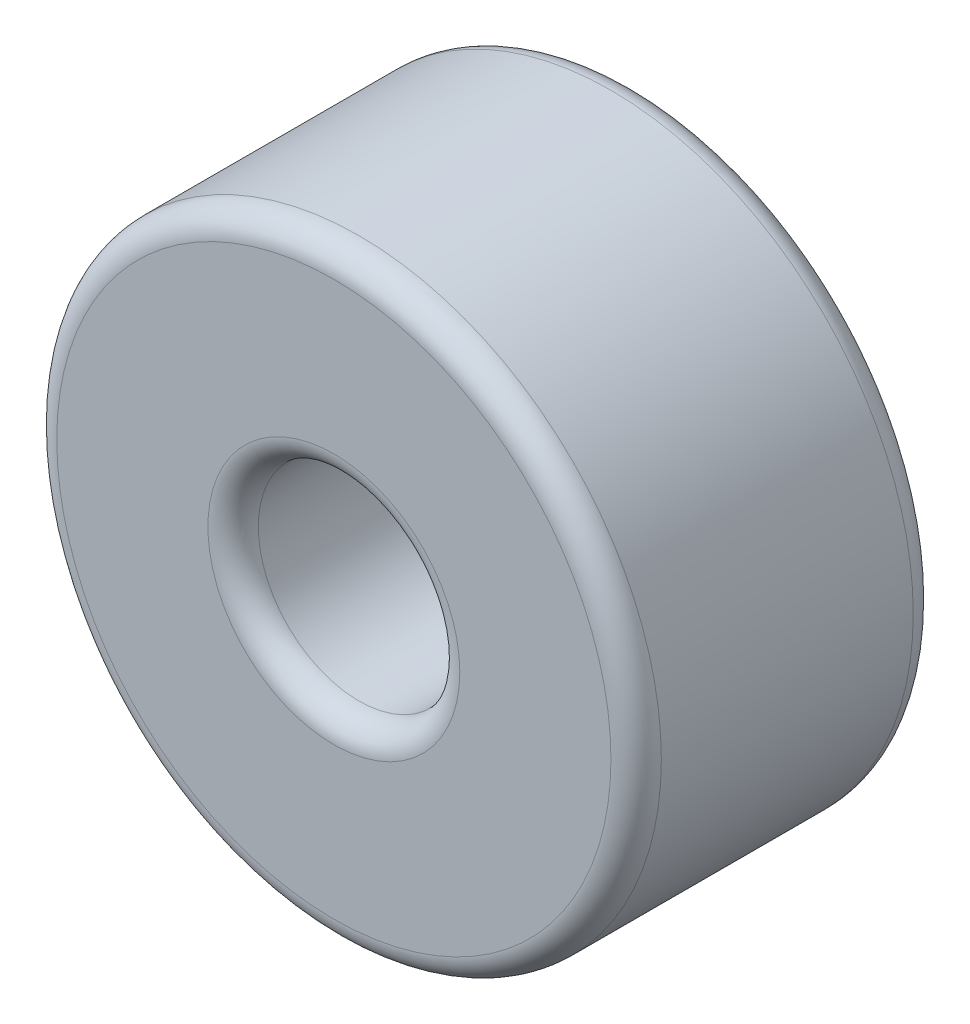
ISO-10303-21;
HEADER;
FILE_DESCRIPTION(('STEP AP214'),'2;1');
FILE_NAME('part.step','',(''),(''),'','','');
FILE_SCHEMA(('AUTOMOTIVE_DESIGN { 1 0 10303 214 1 1 1 1 }'));
ENDSEC;
DATA;
#1=APPLICATION_CONTEXT('core data for automotive mechanical design processes');
#2=APPLICATION_PROTOCOL_DEFINITION('international standard','automotive_design',2000,#1);
#3=PRODUCT_CONTEXT('',#1,'mechanical');
#4=PRODUCT('Part','Part','',(#3));
#5=PRODUCT_RELATED_PRODUCT_CATEGORY('part','',(#4));
#6=PRODUCT_DEFINITION_FORMATION('','',#4);
#7=PRODUCT_DEFINITION_CONTEXT('part definition',#1,'design');
#8=PRODUCT_DEFINITION('design','',#6,#7);
#9=PRODUCT_DEFINITION_SHAPE('','',#8);
#10=(LENGTH_UNIT() NAMED_UNIT(*) SI_UNIT(.MILLI.,.METRE.));
#11=(NAMED_UNIT(*) PLANE_ANGLE_UNIT() SI_UNIT($,.RADIAN.));
#12=(NAMED_UNIT(*) SI_UNIT($,.STERADIAN.) SOLID_ANGLE_UNIT());
#13=UNCERTAINTY_MEASURE_WITH_UNIT(LENGTH_MEASURE(1.E-05),#10,'distance_accuracy_value','');
#14=(GEOMETRIC_REPRESENTATION_CONTEXT(3) GLOBAL_UNCERTAINTY_ASSIGNED_CONTEXT((#13)) GLOBAL_UNIT_ASSIGNED_CONTEXT((#10,
#11,#12)) REPRESENTATION_CONTEXT('',''));
#15=CARTESIAN_POINT('',(0.,0.,0.));
#16=DIRECTION('',(0.,0.,1.));
#17=DIRECTION('',(1.,0.,0.));
#18=AXIS2_PLACEMENT_3D('',#15,#16,#17);
#19=CARTESIAN_POINT('',(0.,0.,3.));
#20=DIRECTION('',(0.,0.,1.));
#21=DIRECTION('',(1.,0.,0.));
#22=AXIS2_PLACEMENT_3D('',#19,#20,#21);
#23=PLANE('',#22);
#24=CARTESIAN_POINT('',(0.,0.,3.));
#25=DIRECTION('',(0.,0.,1.));
#26=DIRECTION('',(1.,0.,0.));
#27=AXIS2_PLACEMENT_3D('',#24,#25,#26);
#28=CIRCLE('',#27,1.25);
#29=CARTESIAN_POINT('',(1.25,0.,3.));
#30=VERTEX_POINT('',#29);
#31=EDGE_CURVE('E65',#30,#30,#28,.F.);
#32=ORIENTED_EDGE('',*,*,#31,.T.);
#33=EDGE_LOOP('',(#32));
#34=FACE_BOUND('',#33,.T.);
#35=CARTESIAN_POINT('',(0.,0.,3.));
#36=DIRECTION('',(0.,0.,1.));
#37=DIRECTION('',(1.,0.,0.));
#38=AXIS2_PLACEMENT_3D('',#35,#36,#37);
#39=CIRCLE('',#38,2.75);
#40=CARTESIAN_POINT('',(2.75,0.,3.));
#41=VERTEX_POINT('',#40);
#42=EDGE_CURVE('E68',#41,#41,#39,.T.);
#43=ORIENTED_EDGE('',*,*,#42,.T.);
#44=EDGE_LOOP('',(#43));
#45=FACE_BOUND('',#44,.T.);
#46=ADVANCED_FACE('F45',(#34,#45),#23,.T.);
#47=CARTESIAN_POINT('',(0.,0.,0.));
#48=DIRECTION('',(0.,0.,1.));
#49=DIRECTION('',(1.,0.,0.));
#50=AXIS2_PLACEMENT_3D('',#47,#48,#49);
#51=PLANE('',#50);
#52=CARTESIAN_POINT('',(0.,0.,0.));
#53=DIRECTION('',(0.,0.,1.));
#54=DIRECTION('',(1.,0.,0.));
#55=AXIS2_PLACEMENT_3D('',#52,#53,#54);
#56=CIRCLE('',#55,1.25);
#57=CARTESIAN_POINT('',(1.25,0.,0.));
#58=VERTEX_POINT('',#57);
#59=EDGE_CURVE('E11',#58,#58,#56,.T.);
#60=ORIENTED_EDGE('',*,*,#59,.T.);
#61=EDGE_LOOP('',(#60));
#62=FACE_BOUND('',#61,.T.);
#63=CARTESIAN_POINT('',(0.,0.,0.));
#64=DIRECTION('',(0.,0.,1.));
#65=DIRECTION('',(1.,0.,0.));
#66=AXIS2_PLACEMENT_3D('',#63,#64,#65);
#67=CIRCLE('',#66,2.75);
#68=CARTESIAN_POINT('',(2.75,0.,0.));
#69=VERTEX_POINT('',#68);
#70=EDGE_CURVE('E52',#69,#69,#67,.F.);
#71=ORIENTED_EDGE('',*,*,#70,.T.);
#72=EDGE_LOOP('',(#71));
#73=FACE_BOUND('',#72,.T.);
#74=ADVANCED_FACE('F93',(#62,#73),#51,.F.);
#75=CARTESIAN_POINT('',(0.,0.,3.));
#76=DIRECTION('',(0.,0.,-1.));
#77=DIRECTION('',(-1.,0.,0.));
#78=AXIS2_PLACEMENT_3D('',#75,#76,#77);
#79=CYLINDRICAL_SURFACE('',#78,3.);
#80=CARTESIAN_POINT('',(0.,0.,2.75));
#81=DIRECTION('',(0.,0.,1.));
#82=DIRECTION('',(1.,0.,0.));
#83=AXIS2_PLACEMENT_3D('',#80,#81,#82);
#84=CIRCLE('',#83,3.);
#85=CARTESIAN_POINT('',(3.,0.,2.75));
#86=VERTEX_POINT('',#85);
#87=EDGE_CURVE('E56',#86,#86,#84,.F.);
#88=ORIENTED_EDGE('',*,*,#87,.T.);
#89=EDGE_LOOP('',(#88));
#90=FACE_BOUND('',#89,.T.);
#91=CARTESIAN_POINT('',(0.,0.,0.25));
#92=DIRECTION('',(0.,0.,1.));
#93=DIRECTION('',(1.,0.,0.));
#94=AXIS2_PLACEMENT_3D('',#91,#92,#93);
#95=CIRCLE('',#94,3.);
#96=CARTESIAN_POINT('',(3.,0.,0.25));
#97=VERTEX_POINT('',#96);
#98=EDGE_CURVE('E60',#97,#97,#95,.T.);
#99=ORIENTED_EDGE('',*,*,#98,.T.);
#100=EDGE_LOOP('',(#99));
#101=FACE_BOUND('',#100,.T.);
#102=ADVANCED_FACE('F99',(#90,#101),#79,.T.);
#103=CARTESIAN_POINT('',(0.,0.,3.));
#104=DIRECTION('',(0.,0.,-1.));
#105=DIRECTION('',(-1.,0.,0.));
#106=AXIS2_PLACEMENT_3D('',#103,#104,#105);
#107=CYLINDRICAL_SURFACE('',#106,1.);
#108=CARTESIAN_POINT('',(0.,0.,2.75));
#109=DIRECTION('',(0.,0.,1.));
#110=DIRECTION('',(1.,0.,0.));
#111=AXIS2_PLACEMENT_3D('',#108,#109,#110);
#112=CIRCLE('',#111,1.);
#113=CARTESIAN_POINT('',(1.,0.,2.75));
#114=VERTEX_POINT('',#113);
#115=EDGE_CURVE('E71',#114,#114,#112,.T.);
#116=ORIENTED_EDGE('',*,*,#115,.T.);
#117=EDGE_LOOP('',(#116));
#118=FACE_BOUND('',#117,.T.);
#119=CARTESIAN_POINT('',(0.,0.,0.25));
#120=DIRECTION('',(0.,0.,1.));
#121=DIRECTION('',(1.,0.,0.));
#122=AXIS2_PLACEMENT_3D('',#119,#120,#121);
#123=CIRCLE('',#122,1.);
#124=CARTESIAN_POINT('',(1.,0.,0.25));
#125=VERTEX_POINT('',#124);
#126=EDGE_CURVE('E74',#125,#125,#123,.F.);
#127=ORIENTED_EDGE('',*,*,#126,.T.);
#128=EDGE_LOOP('',(#127));
#129=FACE_BOUND('',#128,.T.);
#130=ADVANCED_FACE('F78',(#118,#129),#107,.F.);
#131=CARTESIAN_POINT('',(0.,0.,2.75));
#132=DIRECTION('',(0.,0.,1.));
#133=DIRECTION('',(1.,0.,0.));
#134=AXIS2_PLACEMENT_3D('',#131,#132,#133);
#135=TOROIDAL_SURFACE('',#134,1.25,0.25);
#136=ORIENTED_EDGE('',*,*,#31,.F.);
#137=EDGE_LOOP('',(#136));
#138=FACE_BOUND('',#137,.T.);
#139=ORIENTED_EDGE('',*,*,#115,.F.);
#140=EDGE_LOOP('',(#139));
#141=FACE_BOUND('',#140,.T.);
#142=ADVANCED_FACE('F89',(#138,#141),#135,.T.);
#143=CARTESIAN_POINT('',(0.,0.,2.75));
#144=DIRECTION('',(0.,0.,1.));
#145=DIRECTION('',(1.,0.,0.));
#146=AXIS2_PLACEMENT_3D('',#143,#144,#145);
#147=TOROIDAL_SURFACE('',#146,2.75,0.25);
#148=ORIENTED_EDGE('',*,*,#87,.F.);
#149=EDGE_LOOP('',(#148));
#150=FACE_BOUND('',#149,.T.);
#151=ORIENTED_EDGE('',*,*,#42,.F.);
#152=EDGE_LOOP('',(#151));
#153=FACE_BOUND('',#152,.T.);
#154=ADVANCED_FACE('F83',(#150,#153),#147,.T.);
#155=CARTESIAN_POINT('',(0.,0.,0.25));
#156=DIRECTION('',(0.,0.,1.));
#157=DIRECTION('',(1.,0.,0.));
#158=AXIS2_PLACEMENT_3D('',#155,#156,#157);
#159=TOROIDAL_SURFACE('',#158,1.25,0.25);
#160=ORIENTED_EDGE('',*,*,#126,.F.);
#161=EDGE_LOOP('',(#160));
#162=FACE_BOUND('',#161,.T.);
#163=ORIENTED_EDGE('',*,*,#59,.F.);
#164=EDGE_LOOP('',(#163));
#165=FACE_BOUND('',#164,.T.);
#166=ADVANCED_FACE('F80',(#162,#165),#159,.T.);
#167=CARTESIAN_POINT('',(0.,0.,0.25));
#168=DIRECTION('',(0.,0.,1.));
#169=DIRECTION('',(1.,0.,0.));
#170=AXIS2_PLACEMENT_3D('',#167,#168,#169);
#171=TOROIDAL_SURFACE('',#170,2.75,0.25);
#172=ORIENTED_EDGE('',*,*,#70,.F.);
#173=EDGE_LOOP('',(#172));
#174=FACE_BOUND('',#173,.T.);
#175=ORIENTED_EDGE('',*,*,#98,.F.);
#176=EDGE_LOOP('',(#175));
#177=FACE_BOUND('',#176,.T.);
#178=ADVANCED_FACE('F47',(#174,#177),#171,.T.);
#179=CLOSED_SHELL('',(#46,#74,#102,#130,#142,#154,#166,#178));
#180=MANIFOLD_SOLID_BREP('B2',#179);
#181=ADVANCED_BREP_SHAPE_REPRESENTATION('',(#18,#180),#14);
#182=SHAPE_DEFINITION_REPRESENTATION(#9,#181);
ENDSEC;
END-ISO-10303-21;
